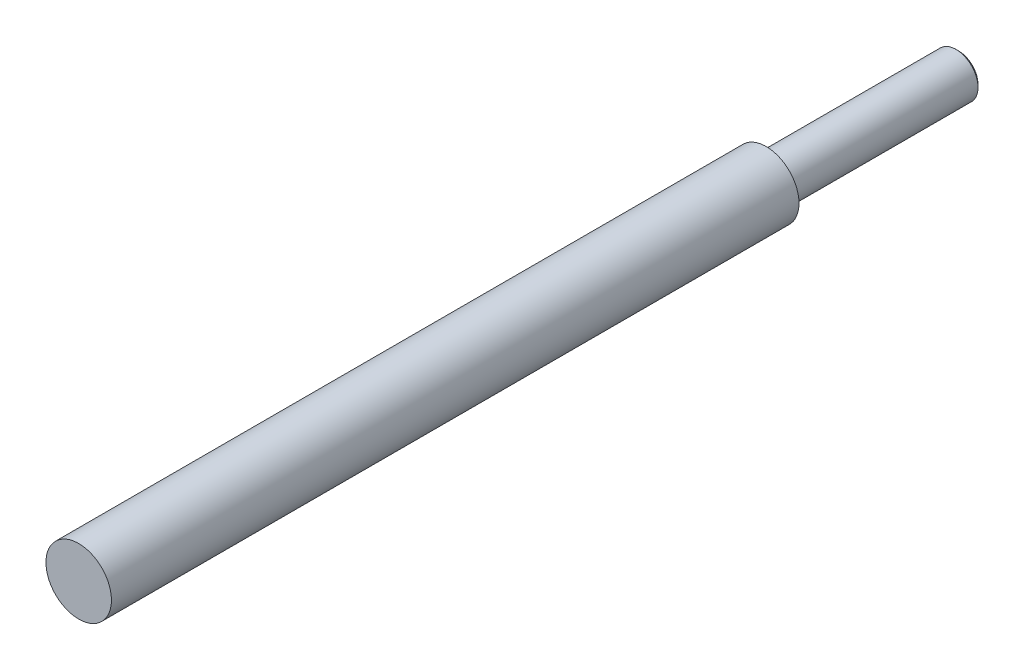
ISO-10303-21;
HEADER;
FILE_DESCRIPTION(('STEP AP214'),'2;1');
FILE_NAME('part.step','',(''),(''),'','','');
FILE_SCHEMA(('AUTOMOTIVE_DESIGN { 1 0 10303 214 1 1 1 1 }'));
ENDSEC;
DATA;
#1=APPLICATION_CONTEXT('core data for automotive mechanical design processes');
#2=APPLICATION_PROTOCOL_DEFINITION('international standard','automotive_design',2000,#1);
#3=PRODUCT_CONTEXT('',#1,'mechanical');
#4=PRODUCT('Part','Part','',(#3));
#5=PRODUCT_RELATED_PRODUCT_CATEGORY('part','',(#4));
#6=PRODUCT_DEFINITION_FORMATION('','',#4);
#7=PRODUCT_DEFINITION_CONTEXT('part definition',#1,'design');
#8=PRODUCT_DEFINITION('design','',#6,#7);
#9=PRODUCT_DEFINITION_SHAPE('','',#8);
#10=(LENGTH_UNIT() NAMED_UNIT(*) SI_UNIT(.MILLI.,.METRE.));
#11=(NAMED_UNIT(*) PLANE_ANGLE_UNIT() SI_UNIT($,.RADIAN.));
#12=(NAMED_UNIT(*) SI_UNIT($,.STERADIAN.) SOLID_ANGLE_UNIT());
#13=UNCERTAINTY_MEASURE_WITH_UNIT(LENGTH_MEASURE(1.E-05),#10,'distance_accuracy_value','');
#14=(GEOMETRIC_REPRESENTATION_CONTEXT(3) GLOBAL_UNCERTAINTY_ASSIGNED_CONTEXT((#13)) GLOBAL_UNIT_ASSIGNED_CONTEXT((#10,
#11,#12)) REPRESENTATION_CONTEXT('',''));
#15=CARTESIAN_POINT('',(0.,0.,0.));
#16=DIRECTION('',(0.,0.,1.));
#17=DIRECTION('',(1.,0.,0.));
#18=AXIS2_PLACEMENT_3D('',#15,#16,#17);
#19=CARTESIAN_POINT('',(4.,0.,0.));
#20=DIRECTION('',(0.,0.,-1.));
#21=DIRECTION('',(-1.,0.,0.));
#22=AXIS2_PLACEMENT_3D('',#19,#20,#21);
#23=PLANE('',#22);
#24=CARTESIAN_POINT('',(0.,0.,5.6843418860808E-11));
#25=DIRECTION('',(0.,0.,1.));
#26=DIRECTION('',(1.,0.,0.));
#27=AXIS2_PLACEMENT_3D('',#24,#25,#26);
#28=CIRCLE('',#27,3.50000000003092);
#29=CARTESIAN_POINT('',(3.50000000003092,0.,5.6843418860808E-11));
#30=VERTEX_POINT('',#29);
#31=EDGE_CURVE('E20',#30,#30,#28,.T.);
#32=ORIENTED_EDGE('',*,*,#31,.F.);
#33=EDGE_LOOP('',(#32));
#34=FACE_BOUND('',#33,.T.);
#35=ADVANCED_FACE('F17',(#34),#23,.T.);
#36=CARTESIAN_POINT('',(0.,0.,0.499999999988177));
#37=DIRECTION('',(0.,0.,1.));
#38=DIRECTION('',(1.,0.,0.));
#39=AXIS2_PLACEMENT_3D('',#36,#37,#38);
#40=CONICAL_SURFACE('',#39,4.0000000000191,0.785398163454292);
#41=ORIENTED_EDGE('',*,*,#31,.T.);
#42=EDGE_LOOP('',(#41));
#43=FACE_BOUND('',#42,.T.);
#44=CARTESIAN_POINT('',(0.,0.,0.5));
#45=DIRECTION('',(0.,0.,1.));
#46=DIRECTION('',(1.,0.,0.));
#47=AXIS2_PLACEMENT_3D('',#44,#45,#46);
#48=CIRCLE('',#47,4.);
#49=CARTESIAN_POINT('',(4.,0.,0.5));
#50=VERTEX_POINT('',#49);
#51=EDGE_CURVE('E90',#50,#50,#48,.T.);
#52=ORIENTED_EDGE('',*,*,#51,.F.);
#53=EDGE_LOOP('',(#52));
#54=FACE_BOUND('',#53,.T.);
#55=ADVANCED_FACE('F128',(#43,#54),#40,.T.);
#56=CARTESIAN_POINT('',(0.,0.,17.5));
#57=DIRECTION('',(0.,0.,1.));
#58=DIRECTION('',(1.,0.,0.));
#59=AXIS2_PLACEMENT_3D('',#56,#57,#58);
#60=CYLINDRICAL_SURFACE('',#59,4.);
#61=ORIENTED_EDGE('',*,*,#51,.T.);
#62=EDGE_LOOP('',(#61));
#63=FACE_BOUND('',#62,.T.);
#64=CARTESIAN_POINT('',(0.,0.,34.7));
#65=DIRECTION('',(0.,0.,1.));
#66=DIRECTION('',(1.,0.,0.));
#67=AXIS2_PLACEMENT_3D('',#64,#65,#66);
#68=CIRCLE('',#67,4.);
#69=CARTESIAN_POINT('',(4.,0.,34.7));
#70=VERTEX_POINT('',#69);
#71=EDGE_CURVE('E41',#70,#70,#68,.F.);
#72=ORIENTED_EDGE('',*,*,#71,.T.);
#73=EDGE_LOOP('',(#72));
#74=FACE_BOUND('',#73,.T.);
#75=ADVANCED_FACE('F75',(#63,#74),#60,.T.);
#76=CARTESIAN_POINT('',(0.,0.,34.7));
#77=DIRECTION('',(0.,0.,1.));
#78=DIRECTION('',(1.,0.,0.));
#79=AXIS2_PLACEMENT_3D('',#76,#77,#78);
#80=TOROIDAL_SURFACE('',#79,4.3,0.3);
#81=CARTESIAN_POINT('',(0.,0.,35.));
#82=DIRECTION('',(0.,0.,-1.));
#83=DIRECTION('',(1.,0.,0.));
#84=AXIS2_PLACEMENT_3D('',#81,#82,#83);
#85=CIRCLE('',#84,4.3);
#86=CARTESIAN_POINT('',(-4.3,0.,35.));
#87=VERTEX_POINT('',#86);
#88=CARTESIAN_POINT('',(4.3,0.,35.));
#89=VERTEX_POINT('',#88);
#90=EDGE_CURVE('E35',#87,#89,#85,.F.);
#91=ORIENTED_EDGE('',*,*,#90,.F.);
#92=CARTESIAN_POINT('',(0.,0.,35.));
#93=DIRECTION('',(0.,0.,-1.));
#94=DIRECTION('',(-1.,0.,0.));
#95=AXIS2_PLACEMENT_3D('',#92,#93,#94);
#96=CIRCLE('',#95,4.3);
#97=EDGE_CURVE('E32',#89,#87,#96,.F.);
#98=ORIENTED_EDGE('',*,*,#97,.F.);
#99=EDGE_LOOP('',(#91,#98));
#100=FACE_BOUND('',#99,.T.);
#101=ORIENTED_EDGE('',*,*,#71,.F.);
#102=EDGE_LOOP('',(#101));
#103=FACE_BOUND('',#102,.T.);
#104=ADVANCED_FACE('F37',(#100,#103),#80,.F.);
#105=CARTESIAN_POINT('',(0.,0.,160.));
#106=DIRECTION('',(0.,0.,1.));
#107=DIRECTION('',(1.,0.,0.));
#108=AXIS2_PLACEMENT_3D('',#105,#106,#107);
#109=PLANE('',#108);
#110=CARTESIAN_POINT('',(0.,0.,160.));
#111=DIRECTION('',(0.,0.,1.));
#112=DIRECTION('',(1.,0.,0.));
#113=AXIS2_PLACEMENT_3D('',#110,#111,#112);
#114=CIRCLE('',#113,5.955);
#115=CARTESIAN_POINT('',(5.955,0.,160.));
#116=VERTEX_POINT('',#115);
#117=EDGE_CURVE('E26',#116,#116,#114,.F.);
#118=ORIENTED_EDGE('',*,*,#117,.F.);
#119=EDGE_LOOP('',(#118));
#120=FACE_BOUND('',#119,.T.);
#121=ADVANCED_FACE('F67',(#120),#109,.T.);
#122=CARTESIAN_POINT('',(6.,0.,35.));
#123=DIRECTION('',(0.,0.,-1.));
#124=DIRECTION('',(-1.,0.,0.));
#125=AXIS2_PLACEMENT_3D('',#122,#123,#124);
#126=PLANE('',#125);
#127=ORIENTED_EDGE('',*,*,#90,.T.);
#128=ORIENTED_EDGE('',*,*,#97,.T.);
#129=EDGE_LOOP('',(#127,#128));
#130=FACE_BOUND('',#129,.T.);
#131=CARTESIAN_POINT('',(0.,0.,35.));
#132=DIRECTION('',(0.,0.,1.));
#133=DIRECTION('',(1.,0.,0.));
#134=AXIS2_PLACEMENT_3D('',#131,#132,#133);
#135=CIRCLE('',#134,5.955);
#136=CARTESIAN_POINT('',(5.955,0.,35.));
#137=VERTEX_POINT('',#136);
#138=EDGE_CURVE('E11',#137,#137,#135,.T.);
#139=ORIENTED_EDGE('',*,*,#138,.F.);
#140=EDGE_LOOP('',(#139));
#141=FACE_BOUND('',#140,.T.);
#142=ADVANCED_FACE('F45',(#130,#141),#126,.T.);
#143=CARTESIAN_POINT('',(0.,0.,97.5));
#144=DIRECTION('',(0.,0.,1.));
#145=DIRECTION('',(1.,0.,0.));
#146=AXIS2_PLACEMENT_3D('',#143,#144,#145);
#147=CYLINDRICAL_SURFACE('',#146,5.955);
#148=ORIENTED_EDGE('',*,*,#138,.T.);
#149=EDGE_LOOP('',(#148));
#150=FACE_BOUND('',#149,.T.);
#151=ORIENTED_EDGE('',*,*,#117,.T.);
#152=EDGE_LOOP('',(#151));
#153=FACE_BOUND('',#152,.T.);
#154=ADVANCED_FACE('F66',(#150,#153),#147,.T.);
#155=CLOSED_SHELL('',(#35,#55,#75,#104,#121,#142,#154));
#156=MANIFOLD_SOLID_BREP('B1',#155);
#157=ADVANCED_BREP_SHAPE_REPRESENTATION('',(#18,#156),#14);
#158=SHAPE_DEFINITION_REPRESENTATION(#9,#157);
ENDSEC;
END-ISO-10303-21;
